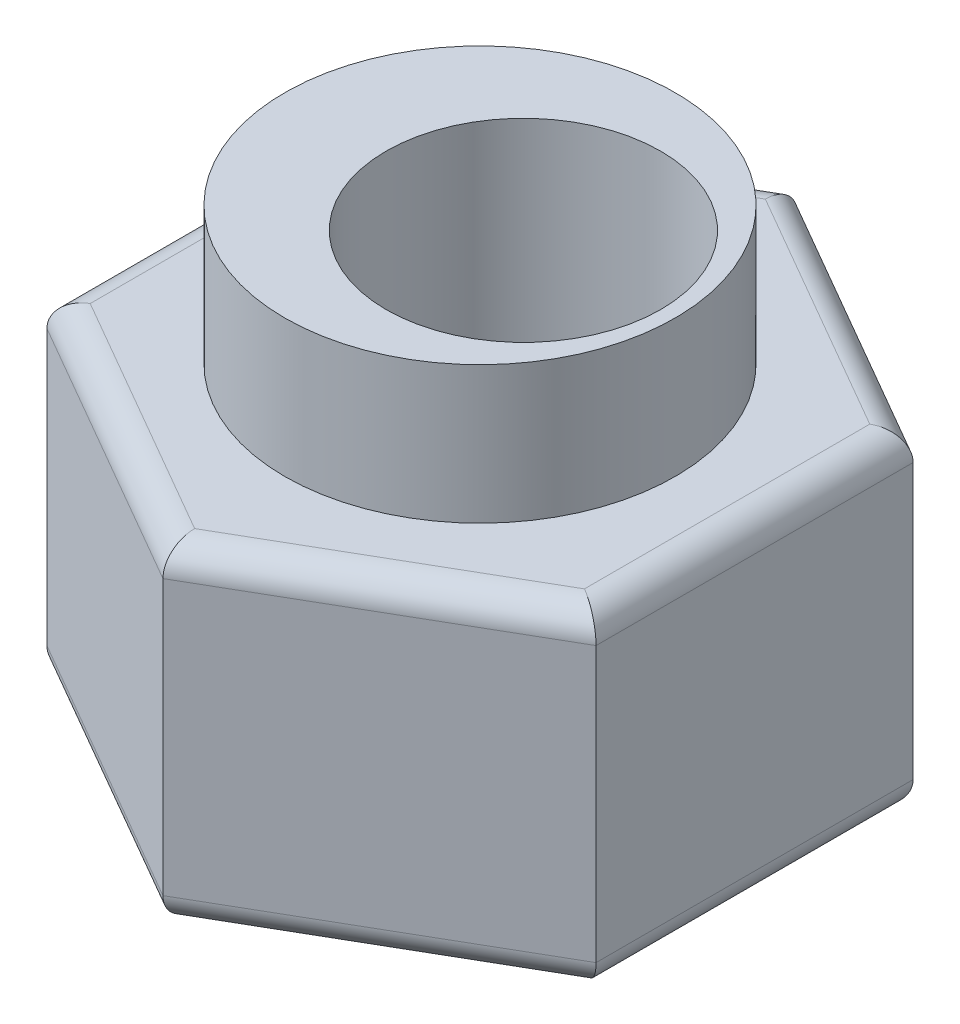
ISO-10303-21;
HEADER;
FILE_DESCRIPTION(('STEP AP214'),'2;1');
FILE_NAME('part.step','',(''),(''),'','','');
FILE_SCHEMA(('AUTOMOTIVE_DESIGN { 1 0 10303 214 1 1 1 1 }'));
ENDSEC;
DATA;
#1=APPLICATION_CONTEXT('core data for automotive mechanical design processes');
#2=APPLICATION_PROTOCOL_DEFINITION('international standard','automotive_design',2000,#1);
#3=PRODUCT_CONTEXT('',#1,'mechanical');
#4=PRODUCT('Part','Part','',(#3));
#5=PRODUCT_RELATED_PRODUCT_CATEGORY('part','',(#4));
#6=PRODUCT_DEFINITION_FORMATION('','',#4);
#7=PRODUCT_DEFINITION_CONTEXT('part definition',#1,'design');
#8=PRODUCT_DEFINITION('design','',#6,#7);
#9=PRODUCT_DEFINITION_SHAPE('','',#8);
#10=(LENGTH_UNIT() NAMED_UNIT(*) SI_UNIT(.MILLI.,.METRE.));
#11=(NAMED_UNIT(*) PLANE_ANGLE_UNIT() SI_UNIT($,.RADIAN.));
#12=(NAMED_UNIT(*) SI_UNIT($,.STERADIAN.) SOLID_ANGLE_UNIT());
#13=UNCERTAINTY_MEASURE_WITH_UNIT(LENGTH_MEASURE(1.E-05),#10,'distance_accuracy_value','');
#14=(GEOMETRIC_REPRESENTATION_CONTEXT(3) GLOBAL_UNCERTAINTY_ASSIGNED_CONTEXT((#13)) GLOBAL_UNIT_ASSIGNED_CONTEXT((#10,
#11,#12)) REPRESENTATION_CONTEXT('',''));
#15=CARTESIAN_POINT('',(0.,0.,0.));
#16=DIRECTION('',(0.,0.,1.));
#17=DIRECTION('',(1.,0.,0.));
#18=AXIS2_PLACEMENT_3D('',#15,#16,#17);
#19=CARTESIAN_POINT('',(0.,6.,5.77350269189626));
#20=DIRECTION('',(-0.5,0.,-0.866025403784439));
#21=DIRECTION('',(-0.866025403784439,0.,0.5));
#22=AXIS2_PLACEMENT_3D('',#19,#20,#21);
#23=PLANE('',#22);
#24=DIRECTION('',(0.,-1.,0.));
#25=VECTOR('',#24,1.);
#26=CARTESIAN_POINT('',(0.,6.,5.77350269189626));
#27=LINE('',#26,#25);
#28=CARTESIAN_POINT('',(0.,5.5,5.77350269189626));
#29=VERTEX_POINT('',#28);
#30=CARTESIAN_POINT('',(0.,0.5,5.77350269189626));
#31=VERTEX_POINT('',#30);
#32=EDGE_CURVE('E163',#29,#31,#27,.T.);
#33=ORIENTED_EDGE('',*,*,#32,.T.);
#34=DIRECTION('',(0.866025403784439,0.,-0.5));
#35=VECTOR('',#34,1.);
#36=CARTESIAN_POINT('',(0.,0.5,5.77350269189626));
#37=LINE('',#36,#35);
#38=CARTESIAN_POINT('',(5.,0.5,2.88675134594813));
#39=VERTEX_POINT('',#38);
#40=EDGE_CURVE('E196',#31,#39,#37,.T.);
#41=ORIENTED_EDGE('',*,*,#40,.T.);
#42=DIRECTION('',(0.,-1.,0.));
#43=VECTOR('',#42,1.);
#44=CARTESIAN_POINT('',(5.,6.,2.88675134594813));
#45=LINE('',#44,#43);
#46=CARTESIAN_POINT('',(5.,5.5,2.88675134594813));
#47=VERTEX_POINT('',#46);
#48=EDGE_CURVE('E169',#47,#39,#45,.T.);
#49=ORIENTED_EDGE('',*,*,#48,.F.);
#50=DIRECTION('',(0.866025403784439,0.,-0.5));
#51=VECTOR('',#50,1.);
#52=CARTESIAN_POINT('',(0.,5.5,5.77350269189626));
#53=LINE('',#52,#51);
#54=EDGE_CURVE('E194',#47,#29,#53,.F.);
#55=ORIENTED_EDGE('',*,*,#54,.T.);
#56=EDGE_LOOP('',(#33,#41,#49,#55));
#57=FACE_BOUND('',#56,.T.);
#58=ADVANCED_FACE('F36',(#57),#23,.F.);
#59=CARTESIAN_POINT('',(5.,6.,2.88675134594813));
#60=DIRECTION('',(-1.,0.,0.));
#61=DIRECTION('',(0.,0.,1.));
#62=AXIS2_PLACEMENT_3D('',#59,#60,#61);
#63=PLANE('',#62);
#64=ORIENTED_EDGE('',*,*,#48,.T.);
#65=DIRECTION('',(0.,0.,-1.));
#66=VECTOR('',#65,1.);
#67=CARTESIAN_POINT('',(5.,0.5,2.88675134594813));
#68=LINE('',#67,#66);
#69=CARTESIAN_POINT('',(5.,0.5,-2.88675134594813));
#70=VERTEX_POINT('',#69);
#71=EDGE_CURVE('E192',#39,#70,#68,.T.);
#72=ORIENTED_EDGE('',*,*,#71,.T.);
#73=DIRECTION('',(0.,-1.,0.));
#74=VECTOR('',#73,1.);
#75=CARTESIAN_POINT('',(5.,6.,-2.88675134594813));
#76=LINE('',#75,#74);
#77=CARTESIAN_POINT('',(5.,5.5,-2.88675134594813));
#78=VERTEX_POINT('',#77);
#79=EDGE_CURVE('E161',#78,#70,#76,.T.);
#80=ORIENTED_EDGE('',*,*,#79,.F.);
#81=DIRECTION('',(0.,0.,-1.));
#82=VECTOR('',#81,1.);
#83=CARTESIAN_POINT('',(5.,5.5,2.88675134594813));
#84=LINE('',#83,#82);
#85=EDGE_CURVE('E190',#78,#47,#84,.F.);
#86=ORIENTED_EDGE('',*,*,#85,.T.);
#87=EDGE_LOOP('',(#64,#72,#80,#86));
#88=FACE_BOUND('',#87,.T.);
#89=ADVANCED_FACE('F247',(#88),#63,.F.);
#90=CARTESIAN_POINT('',(5.,6.,-2.88675134594813));
#91=DIRECTION('',(-0.5,0.,0.866025403784439));
#92=DIRECTION('',(0.866025403784439,0.,0.5));
#93=AXIS2_PLACEMENT_3D('',#90,#91,#92);
#94=PLANE('',#93);
#95=ORIENTED_EDGE('',*,*,#79,.T.);
#96=DIRECTION('',(-0.866025403784439,0.,-0.5));
#97=VECTOR('',#96,1.);
#98=CARTESIAN_POINT('',(5.,0.5,-2.88675134594813));
#99=LINE('',#98,#97);
#100=CARTESIAN_POINT('',(0.,0.5,-5.77350269189626));
#101=VERTEX_POINT('',#100);
#102=EDGE_CURVE('E188',#70,#101,#99,.T.);
#103=ORIENTED_EDGE('',*,*,#102,.T.);
#104=DIRECTION('',(0.,-1.,0.));
#105=VECTOR('',#104,1.);
#106=CARTESIAN_POINT('',(0.,6.,-5.77350269189626));
#107=LINE('',#106,#105);
#108=CARTESIAN_POINT('',(0.,5.5,-5.77350269189626));
#109=VERTEX_POINT('',#108);
#110=EDGE_CURVE('E159',#109,#101,#107,.T.);
#111=ORIENTED_EDGE('',*,*,#110,.F.);
#112=DIRECTION('',(-0.866025403784439,0.,-0.5));
#113=VECTOR('',#112,1.);
#114=CARTESIAN_POINT('',(5.,5.5,-2.88675134594813));
#115=LINE('',#114,#113);
#116=EDGE_CURVE('E186',#109,#78,#115,.F.);
#117=ORIENTED_EDGE('',*,*,#116,.T.);
#118=EDGE_LOOP('',(#95,#103,#111,#117));
#119=FACE_BOUND('',#118,.T.);
#120=ADVANCED_FACE('F274',(#119),#94,.F.);
#121=CARTESIAN_POINT('',(0.,6.,-5.77350269189626));
#122=DIRECTION('',(0.5,0.,0.866025403784439));
#123=DIRECTION('',(0.866025403784439,0.,-0.5));
#124=AXIS2_PLACEMENT_3D('',#121,#122,#123);
#125=PLANE('',#124);
#126=ORIENTED_EDGE('',*,*,#110,.T.);
#127=DIRECTION('',(-0.866025403784439,0.,0.5));
#128=VECTOR('',#127,1.);
#129=CARTESIAN_POINT('',(0.,0.5,-5.77350269189626));
#130=LINE('',#129,#128);
#131=CARTESIAN_POINT('',(-5.,0.5,-2.88675134594813));
#132=VERTEX_POINT('',#131);
#133=EDGE_CURVE('E143',#101,#132,#130,.T.);
#134=ORIENTED_EDGE('',*,*,#133,.T.);
#135=DIRECTION('',(0.,-1.,0.));
#136=VECTOR('',#135,1.);
#137=CARTESIAN_POINT('',(-5.,6.,-2.88675134594813));
#138=LINE('',#137,#136);
#139=CARTESIAN_POINT('',(-5.,5.5,-2.88675134594813));
#140=VERTEX_POINT('',#139);
#141=EDGE_CURVE('E150',#140,#132,#138,.T.);
#142=ORIENTED_EDGE('',*,*,#141,.F.);
#143=DIRECTION('',(-0.866025403784439,0.,0.5));
#144=VECTOR('',#143,1.);
#145=CARTESIAN_POINT('',(0.,5.5,-5.77350269189626));
#146=LINE('',#145,#144);
#147=EDGE_CURVE('E136',#140,#109,#146,.F.);
#148=ORIENTED_EDGE('',*,*,#147,.T.);
#149=EDGE_LOOP('',(#126,#134,#142,#148));
#150=FACE_BOUND('',#149,.T.);
#151=ADVANCED_FACE('F157',(#150),#125,.F.);
#152=CARTESIAN_POINT('',(-5.,6.,-2.88675134594813));
#153=DIRECTION('',(1.,0.,0.));
#154=DIRECTION('',(0.,0.,-1.));
#155=AXIS2_PLACEMENT_3D('',#152,#153,#154);
#156=PLANE('',#155);
#157=ORIENTED_EDGE('',*,*,#141,.T.);
#158=DIRECTION('',(0.,0.,1.));
#159=VECTOR('',#158,1.);
#160=CARTESIAN_POINT('',(-5.,0.5,-2.88675134594813));
#161=LINE('',#160,#159);
#162=CARTESIAN_POINT('',(-5.,0.5,2.88675134594813));
#163=VERTEX_POINT('',#162);
#164=EDGE_CURVE('E153',#132,#163,#161,.T.);
#165=ORIENTED_EDGE('',*,*,#164,.T.);
#166=DIRECTION('',(0.,-1.,0.));
#167=VECTOR('',#166,1.);
#168=CARTESIAN_POINT('',(-5.,6.,2.88675134594813));
#169=LINE('',#168,#167);
#170=CARTESIAN_POINT('',(-5.,5.5,2.88675134594813));
#171=VERTEX_POINT('',#170);
#172=EDGE_CURVE('E152',#171,#163,#169,.T.);
#173=ORIENTED_EDGE('',*,*,#172,.F.);
#174=DIRECTION('',(0.,0.,1.));
#175=VECTOR('',#174,1.);
#176=CARTESIAN_POINT('',(-5.,5.5,-2.88675134594813));
#177=LINE('',#176,#175);
#178=EDGE_CURVE('E129',#171,#140,#177,.F.);
#179=ORIENTED_EDGE('',*,*,#178,.T.);
#180=EDGE_LOOP('',(#157,#165,#173,#179));
#181=FACE_BOUND('',#180,.T.);
#182=ADVANCED_FACE('F149',(#181),#156,.F.);
#183=CARTESIAN_POINT('',(-5.,6.,2.88675134594813));
#184=DIRECTION('',(0.5,0.,-0.866025403784439));
#185=DIRECTION('',(-0.866025403784439,0.,-0.5));
#186=AXIS2_PLACEMENT_3D('',#183,#184,#185);
#187=PLANE('',#186);
#188=ORIENTED_EDGE('',*,*,#172,.T.);
#189=DIRECTION('',(0.866025403784439,0.,0.5));
#190=VECTOR('',#189,1.);
#191=CARTESIAN_POINT('',(-5.,0.5,2.88675134594813));
#192=LINE('',#191,#190);
#193=EDGE_CURVE('E154',#163,#31,#192,.T.);
#194=ORIENTED_EDGE('',*,*,#193,.T.);
#195=ORIENTED_EDGE('',*,*,#32,.F.);
#196=DIRECTION('',(0.866025403784439,0.,0.5));
#197=VECTOR('',#196,1.);
#198=CARTESIAN_POINT('',(-5.,5.5,2.88675134594813));
#199=LINE('',#198,#197);
#200=EDGE_CURVE('E198',#29,#171,#199,.F.);
#201=ORIENTED_EDGE('',*,*,#200,.T.);
#202=EDGE_LOOP('',(#188,#194,#195,#201));
#203=FACE_BOUND('',#202,.T.);
#204=ADVANCED_FACE('F286',(#203),#187,.F.);
#205=CARTESIAN_POINT('',(0.,6.,0.));
#206=DIRECTION('',(0.,1.,0.));
#207=DIRECTION('',(0.,0.,1.));
#208=AXIS2_PLACEMENT_3D('',#205,#206,#207);
#209=PLANE('',#208);
#210=DIRECTION('',(-0.866025403784439,0.,0.5));
#211=VECTOR('',#210,1.);
#212=CARTESIAN_POINT('',(-4.75,6.,-2.45373864405591));
#213=LINE('',#212,#211);
#214=CARTESIAN_POINT('',(0.,6.,-5.19615242270663));
#215=VERTEX_POINT('',#214);
#216=CARTESIAN_POINT('',(-4.5,6.,-2.59807621135332));
#217=VERTEX_POINT('',#216);
#218=EDGE_CURVE('E45',#215,#217,#213,.T.);
#219=ORIENTED_EDGE('',*,*,#218,.T.);
#220=DIRECTION('',(0.,0.,1.));
#221=VECTOR('',#220,1.);
#222=CARTESIAN_POINT('',(-4.5,6.,2.88675134594813));
#223=LINE('',#222,#221);
#224=CARTESIAN_POINT('',(-4.5,6.,2.59807621135332));
#225=VERTEX_POINT('',#224);
#226=EDGE_CURVE('E11',#217,#225,#223,.T.);
#227=ORIENTED_EDGE('',*,*,#226,.T.);
#228=DIRECTION('',(0.866025403784439,0.,0.5));
#229=VECTOR('',#228,1.);
#230=CARTESIAN_POINT('',(0.250000000000001,6.,5.34048999000404));
#231=LINE('',#230,#229);
#232=CARTESIAN_POINT('',(0.,6.,5.19615242270663));
#233=VERTEX_POINT('',#232);
#234=EDGE_CURVE('E202',#225,#233,#231,.T.);
#235=ORIENTED_EDGE('',*,*,#234,.T.);
#236=DIRECTION('',(0.866025403784439,0.,-0.5));
#237=VECTOR('',#236,1.);
#238=CARTESIAN_POINT('',(4.75,6.,2.45373864405591));
#239=LINE('',#238,#237);
#240=CARTESIAN_POINT('',(4.5,6.,2.59807621135332));
#241=VERTEX_POINT('',#240);
#242=EDGE_CURVE('E204',#233,#241,#239,.T.);
#243=ORIENTED_EDGE('',*,*,#242,.T.);
#244=DIRECTION('',(0.,0.,-1.));
#245=VECTOR('',#244,1.);
#246=CARTESIAN_POINT('',(4.5,6.,-2.88675134594813));
#247=LINE('',#246,#245);
#248=CARTESIAN_POINT('',(4.5,6.,-2.59807621135332));
#249=VERTEX_POINT('',#248);
#250=EDGE_CURVE('E206',#241,#249,#247,.T.);
#251=ORIENTED_EDGE('',*,*,#250,.T.);
#252=DIRECTION('',(-0.866025403784439,0.,-0.5));
#253=VECTOR('',#252,1.);
#254=CARTESIAN_POINT('',(-0.250000000000001,6.,-5.34048999000404));
#255=LINE('',#254,#253);
#256=EDGE_CURVE('E56',#249,#215,#255,.T.);
#257=ORIENTED_EDGE('',*,*,#256,.T.);
#258=EDGE_LOOP('',(#219,#227,#235,#243,#251,#257));
#259=FACE_BOUND('',#258,.T.);
#260=CARTESIAN_POINT('',(0.,6.,0.));
#261=DIRECTION('',(0.,1.,0.));
#262=DIRECTION('',(0.,0.,1.));
#263=AXIS2_PLACEMENT_3D('',#260,#261,#262);
#264=CIRCLE('',#263,3.555);
#265=CARTESIAN_POINT('',(0.,6.,3.555));
#266=VERTEX_POINT('',#265);
#267=EDGE_CURVE('E144',#266,#266,#264,.T.);
#268=ORIENTED_EDGE('',*,*,#267,.F.);
#269=EDGE_LOOP('',(#268));
#270=FACE_BOUND('',#269,.T.);
#271=ADVANCED_FACE('F292',(#259,#270),#209,.T.);
#272=CARTESIAN_POINT('',(0.,0.,0.));
#273=DIRECTION('',(0.,1.,0.));
#274=DIRECTION('',(0.,0.,1.));
#275=AXIS2_PLACEMENT_3D('',#272,#273,#274);
#276=PLANE('',#275);
#277=DIRECTION('',(0.,0.,1.));
#278=VECTOR('',#277,1.);
#279=CARTESIAN_POINT('',(-4.5,0.,0.));
#280=LINE('',#279,#278);
#281=CARTESIAN_POINT('',(-4.5,0.,2.59807621135332));
#282=VERTEX_POINT('',#281);
#283=CARTESIAN_POINT('',(-4.5,0.,-2.59807621135332));
#284=VERTEX_POINT('',#283);
#285=EDGE_CURVE('E173',#282,#284,#280,.F.);
#286=ORIENTED_EDGE('',*,*,#285,.T.);
#287=DIRECTION('',(-0.866025403784439,0.,0.5));
#288=VECTOR('',#287,1.);
#289=CARTESIAN_POINT('',(-2.25,0.,-3.89711431702998));
#290=LINE('',#289,#288);
#291=CARTESIAN_POINT('',(0.,0.,-5.19615242270663));
#292=VERTEX_POINT('',#291);
#293=EDGE_CURVE('E183',#284,#292,#290,.F.);
#294=ORIENTED_EDGE('',*,*,#293,.T.);
#295=DIRECTION('',(-0.866025403784439,0.,-0.5));
#296=VECTOR('',#295,1.);
#297=CARTESIAN_POINT('',(2.25,0.,-3.89711431702997));
#298=LINE('',#297,#296);
#299=CARTESIAN_POINT('',(4.5,0.,-2.59807621135332));
#300=VERTEX_POINT('',#299);
#301=EDGE_CURVE('E181',#292,#300,#298,.F.);
#302=ORIENTED_EDGE('',*,*,#301,.T.);
#303=DIRECTION('',(0.,0.,-1.));
#304=VECTOR('',#303,1.);
#305=CARTESIAN_POINT('',(4.5,0.,0.));
#306=LINE('',#305,#304);
#307=CARTESIAN_POINT('',(4.5,0.,2.59807621135332));
#308=VERTEX_POINT('',#307);
#309=EDGE_CURVE('E179',#300,#308,#306,.F.);
#310=ORIENTED_EDGE('',*,*,#309,.T.);
#311=DIRECTION('',(0.866025403784439,0.,-0.5));
#312=VECTOR('',#311,1.);
#313=CARTESIAN_POINT('',(2.25,0.,3.89711431702997));
#314=LINE('',#313,#312);
#315=CARTESIAN_POINT('',(0.,0.,5.19615242270663));
#316=VERTEX_POINT('',#315);
#317=EDGE_CURVE('E177',#308,#316,#314,.F.);
#318=ORIENTED_EDGE('',*,*,#317,.T.);
#319=DIRECTION('',(0.866025403784439,0.,0.5));
#320=VECTOR('',#319,1.);
#321=CARTESIAN_POINT('',(-2.25,0.,3.89711431702997));
#322=LINE('',#321,#320);
#323=EDGE_CURVE('E175',#316,#282,#322,.F.);
#324=ORIENTED_EDGE('',*,*,#323,.T.);
#325=EDGE_LOOP('',(#286,#294,#302,#310,#318,#324));
#326=FACE_BOUND('',#325,.T.);
#327=CARTESIAN_POINT('',(0.79,0.,0.));
#328=DIRECTION('',(0.,1.,0.));
#329=DIRECTION('',(0.,0.,1.));
#330=AXIS2_PLACEMENT_3D('',#327,#328,#329);
#331=CIRCLE('',#330,2.5);
#332=CARTESIAN_POINT('',(0.79,0.,2.5));
#333=VERTEX_POINT('',#332);
#334=EDGE_CURVE('E304',#333,#333,#331,.T.);
#335=ORIENTED_EDGE('',*,*,#334,.T.);
#336=EDGE_LOOP('',(#335));
#337=FACE_BOUND('',#336,.T.);
#338=ADVANCED_FACE('F265',(#326,#337),#276,.F.);
#339=CARTESIAN_POINT('',(0.,8.5,0.));
#340=DIRECTION('',(0.,-1.,0.));
#341=DIRECTION('',(0.,0.,-1.));
#342=AXIS2_PLACEMENT_3D('',#339,#340,#341);
#343=CYLINDRICAL_SURFACE('',#342,3.555);
#344=CARTESIAN_POINT('',(0.,8.5,0.));
#345=DIRECTION('',(0.,1.,0.));
#346=DIRECTION('',(0.,0.,1.));
#347=AXIS2_PLACEMENT_3D('',#344,#345,#346);
#348=CIRCLE('',#347,3.555);
#349=CARTESIAN_POINT('',(0.,8.5,3.555));
#350=VERTEX_POINT('',#349);
#351=EDGE_CURVE('E301',#350,#350,#348,.T.);
#352=ORIENTED_EDGE('',*,*,#351,.F.);
#353=EDGE_LOOP('',(#352));
#354=FACE_BOUND('',#353,.T.);
#355=ORIENTED_EDGE('',*,*,#267,.T.);
#356=EDGE_LOOP('',(#355));
#357=FACE_BOUND('',#356,.T.);
#358=ADVANCED_FACE('F317',(#354,#357),#343,.T.);
#359=CARTESIAN_POINT('',(0.,8.5,0.));
#360=DIRECTION('',(0.,1.,0.));
#361=DIRECTION('',(0.,0.,1.));
#362=AXIS2_PLACEMENT_3D('',#359,#360,#361);
#363=PLANE('',#362);
#364=CARTESIAN_POINT('',(0.79,8.5,0.));
#365=DIRECTION('',(0.,1.,0.));
#366=DIRECTION('',(0.,0.,1.));
#367=AXIS2_PLACEMENT_3D('',#364,#365,#366);
#368=CIRCLE('',#367,2.5);
#369=CARTESIAN_POINT('',(0.79,8.5,2.5));
#370=VERTEX_POINT('',#369);
#371=EDGE_CURVE('E226',#370,#370,#368,.T.);
#372=ORIENTED_EDGE('',*,*,#371,.F.);
#373=EDGE_LOOP('',(#372));
#374=FACE_BOUND('',#373,.T.);
#375=ORIENTED_EDGE('',*,*,#351,.T.);
#376=EDGE_LOOP('',(#375));
#377=FACE_BOUND('',#376,.T.);
#378=ADVANCED_FACE('F315',(#374,#377),#363,.T.);
#379=CARTESIAN_POINT('',(0.79,0.,0.));
#380=DIRECTION('',(0.,1.,0.));
#381=DIRECTION('',(0.,0.,1.));
#382=AXIS2_PLACEMENT_3D('',#379,#380,#381);
#383=CYLINDRICAL_SURFACE('',#382,2.5);
#384=ORIENTED_EDGE('',*,*,#334,.F.);
#385=EDGE_LOOP('',(#384));
#386=FACE_BOUND('',#385,.T.);
#387=ORIENTED_EDGE('',*,*,#371,.T.);
#388=EDGE_LOOP('',(#387));
#389=FACE_BOUND('',#388,.T.);
#390=ADVANCED_FACE('F313',(#386,#389),#383,.F.);
#391=CARTESIAN_POINT('',(-0.25,0.5,5.34048999000404));
#392=DIRECTION('',(0.866025403784439,0.,-0.5));
#393=DIRECTION('',(-0.5,0.,-0.866025403784439));
#394=AXIS2_PLACEMENT_3D('',#391,#392,#393);
#395=CYLINDRICAL_SURFACE('',#394,0.5);
#396=CARTESIAN_POINT('',(0.,0.5,5.19615242270663));
#397=DIRECTION('',(1.,0.,0.));
#398=DIRECTION('',(0.,0.,1.));
#399=AXIS2_PLACEMENT_3D('',#396,#397,#398);
#400=ELLIPSE('',#399,0.577350269189626,0.5);
#401=EDGE_CURVE('E220',#316,#31,#400,.F.);
#402=ORIENTED_EDGE('',*,*,#401,.F.);
#403=ORIENTED_EDGE('',*,*,#317,.F.);
#404=CARTESIAN_POINT('',(4.5,0.5,2.59807621135332));
#405=DIRECTION('',(0.5,0.,-0.866025403784439));
#406=DIRECTION('',(0.866025403784439,0.,0.5));
#407=AXIS2_PLACEMENT_3D('',#404,#405,#406);
#408=ELLIPSE('',#407,0.577350269189626,0.5);
#409=EDGE_CURVE('E223',#39,#308,#408,.T.);
#410=ORIENTED_EDGE('',*,*,#409,.F.);
#411=ORIENTED_EDGE('',*,*,#40,.F.);
#412=EDGE_LOOP('',(#402,#403,#410,#411));
#413=FACE_BOUND('',#412,.T.);
#414=ADVANCED_FACE('F255',(#413),#395,.T.);
#415=CARTESIAN_POINT('',(4.5,0.5,2.88675134594813));
#416=DIRECTION('',(0.,0.,-1.));
#417=DIRECTION('',(-1.,0.,0.));
#418=AXIS2_PLACEMENT_3D('',#415,#416,#417);
#419=CYLINDRICAL_SURFACE('',#418,0.5);
#420=ORIENTED_EDGE('',*,*,#409,.T.);
#421=ORIENTED_EDGE('',*,*,#309,.F.);
#422=CARTESIAN_POINT('',(4.5,0.5,-2.59807621135332));
#423=DIRECTION('',(-0.5,0.,-0.866025403784439));
#424=DIRECTION('',(0.866025403784439,0.,-0.5));
#425=AXIS2_PLACEMENT_3D('',#422,#423,#424);
#426=ELLIPSE('',#425,0.577350269189626,0.5);
#427=EDGE_CURVE('E217',#70,#300,#426,.T.);
#428=ORIENTED_EDGE('',*,*,#427,.F.);
#429=ORIENTED_EDGE('',*,*,#71,.F.);
#430=EDGE_LOOP('',(#420,#421,#428,#429));
#431=FACE_BOUND('',#430,.T.);
#432=ADVANCED_FACE('F270',(#431),#419,.T.);
#433=CARTESIAN_POINT('',(-4.75,0.5,2.45373864405591));
#434=DIRECTION('',(0.866025403784439,0.,0.5));
#435=DIRECTION('',(0.5,0.,-0.866025403784439));
#436=AXIS2_PLACEMENT_3D('',#433,#434,#435);
#437=CYLINDRICAL_SURFACE('',#436,0.5);
#438=ORIENTED_EDGE('',*,*,#401,.T.);
#439=ORIENTED_EDGE('',*,*,#193,.F.);
#440=CARTESIAN_POINT('',(-4.5,0.5,2.59807621135332));
#441=DIRECTION('',(0.5,0.,0.866025403784439));
#442=DIRECTION('',(-0.866025403784439,0.,0.5));
#443=AXIS2_PLACEMENT_3D('',#440,#441,#442);
#444=ELLIPSE('',#443,0.577350269189626,0.5);
#445=EDGE_CURVE('E214',#282,#163,#444,.F.);
#446=ORIENTED_EDGE('',*,*,#445,.F.);
#447=ORIENTED_EDGE('',*,*,#323,.F.);
#448=EDGE_LOOP('',(#438,#439,#446,#447));
#449=FACE_BOUND('',#448,.T.);
#450=ADVANCED_FACE('F261',(#449),#437,.T.);
#451=CARTESIAN_POINT('',(4.75,0.5,-2.45373864405591));
#452=DIRECTION('',(-0.866025403784439,0.,-0.5));
#453=DIRECTION('',(-0.5,0.,0.866025403784439));
#454=AXIS2_PLACEMENT_3D('',#451,#452,#453);
#455=CYLINDRICAL_SURFACE('',#454,0.5);
#456=ORIENTED_EDGE('',*,*,#427,.T.);
#457=ORIENTED_EDGE('',*,*,#301,.F.);
#458=CARTESIAN_POINT('',(0.,0.5,-5.19615242270663));
#459=DIRECTION('',(-1.,0.,0.));
#460=DIRECTION('',(0.,0.,-1.));
#461=AXIS2_PLACEMENT_3D('',#458,#459,#460);
#462=ELLIPSE('',#461,0.577350269189626,0.5);
#463=EDGE_CURVE('E212',#101,#292,#462,.T.);
#464=ORIENTED_EDGE('',*,*,#463,.F.);
#465=ORIENTED_EDGE('',*,*,#102,.F.);
#466=EDGE_LOOP('',(#456,#457,#464,#465));
#467=FACE_BOUND('',#466,.T.);
#468=ADVANCED_FACE('F278',(#467),#455,.T.);
#469=CARTESIAN_POINT('',(-4.5,0.5,-2.88675134594813));
#470=DIRECTION('',(0.,0.,1.));
#471=DIRECTION('',(1.,0.,0.));
#472=AXIS2_PLACEMENT_3D('',#469,#470,#471);
#473=CYLINDRICAL_SURFACE('',#472,0.5);
#474=ORIENTED_EDGE('',*,*,#445,.T.);
#475=ORIENTED_EDGE('',*,*,#164,.F.);
#476=CARTESIAN_POINT('',(-4.5,0.5,-2.59807621135332));
#477=DIRECTION('',(-0.5,0.,0.866025403784439));
#478=DIRECTION('',(0.866025403784439,0.,0.5));
#479=AXIS2_PLACEMENT_3D('',#476,#477,#478);
#480=ELLIPSE('',#479,0.577350269189626,0.5);
#481=EDGE_CURVE('E210',#284,#132,#480,.F.);
#482=ORIENTED_EDGE('',*,*,#481,.F.);
#483=ORIENTED_EDGE('',*,*,#285,.F.);
#484=EDGE_LOOP('',(#474,#475,#482,#483));
#485=FACE_BOUND('',#484,.T.);
#486=ADVANCED_FACE('F284',(#485),#473,.T.);
#487=CARTESIAN_POINT('',(0.249999999999999,0.5,-5.34048999000404));
#488=DIRECTION('',(-0.866025403784439,0.,0.5));
#489=DIRECTION('',(0.5,0.,0.866025403784439));
#490=AXIS2_PLACEMENT_3D('',#487,#488,#489);
#491=CYLINDRICAL_SURFACE('',#490,0.5);
#492=ORIENTED_EDGE('',*,*,#463,.T.);
#493=ORIENTED_EDGE('',*,*,#293,.F.);
#494=ORIENTED_EDGE('',*,*,#481,.T.);
#495=ORIENTED_EDGE('',*,*,#133,.F.);
#496=EDGE_LOOP('',(#492,#493,#494,#495));
#497=FACE_BOUND('',#496,.T.);
#498=ADVANCED_FACE('F280',(#497),#491,.T.);
#499=CARTESIAN_POINT('',(4.5,5.5,0.));
#500=DIRECTION('',(0.,0.,1.));
#501=DIRECTION('',(1.,0.,0.));
#502=AXIS2_PLACEMENT_3D('',#499,#500,#501);
#503=CYLINDRICAL_SURFACE('',#502,0.5);
#504=CARTESIAN_POINT('',(4.5,5.5,2.59807621135332));
#505=DIRECTION('',(-0.5,0.,0.866025403784439));
#506=DIRECTION('',(-0.866025403784439,0.,-0.5));
#507=AXIS2_PLACEMENT_3D('',#504,#505,#506);
#508=ELLIPSE('',#507,0.577350269189626,0.5);
#509=EDGE_CURVE('E230',#47,#241,#508,.T.);
#510=ORIENTED_EDGE('',*,*,#509,.F.);
#511=ORIENTED_EDGE('',*,*,#85,.F.);
#512=CARTESIAN_POINT('',(4.5,5.5,-2.59807621135332));
#513=DIRECTION('',(0.5,0.,0.866025403784439));
#514=DIRECTION('',(-0.866025403784439,0.,0.5));
#515=AXIS2_PLACEMENT_3D('',#512,#513,#514);
#516=ELLIPSE('',#515,0.577350269189626,0.5);
#517=EDGE_CURVE('E40',#249,#78,#516,.F.);
#518=ORIENTED_EDGE('',*,*,#517,.F.);
#519=ORIENTED_EDGE('',*,*,#250,.F.);
#520=EDGE_LOOP('',(#510,#511,#518,#519));
#521=FACE_BOUND('',#520,.T.);
#522=ADVANCED_FACE('F38',(#521),#503,.T.);
#523=CARTESIAN_POINT('',(2.25,5.5,-3.89711431702998));
#524=DIRECTION('',(0.866025403784439,0.,0.5));
#525=DIRECTION('',(0.5,0.,-0.866025403784439));
#526=AXIS2_PLACEMENT_3D('',#523,#524,#525);
#527=CYLINDRICAL_SURFACE('',#526,0.5);
#528=ORIENTED_EDGE('',*,*,#517,.T.);
#529=ORIENTED_EDGE('',*,*,#116,.F.);
#530=CARTESIAN_POINT('',(0.,5.5,-5.19615242270663));
#531=DIRECTION('',(1.,0.,0.));
#532=DIRECTION('',(0.,0.,1.));
#533=AXIS2_PLACEMENT_3D('',#530,#531,#532);
#534=ELLIPSE('',#533,0.577350269189626,0.5);
#535=EDGE_CURVE('E138',#215,#109,#534,.F.);
#536=ORIENTED_EDGE('',*,*,#535,.F.);
#537=ORIENTED_EDGE('',*,*,#256,.F.);
#538=EDGE_LOOP('',(#528,#529,#536,#537));
#539=FACE_BOUND('',#538,.T.);
#540=ADVANCED_FACE('F240',(#539),#527,.T.);
#541=CARTESIAN_POINT('',(2.25,5.5,3.89711431702997));
#542=DIRECTION('',(-0.866025403784439,0.,0.5));
#543=DIRECTION('',(0.5,0.,0.866025403784439));
#544=AXIS2_PLACEMENT_3D('',#541,#542,#543);
#545=CYLINDRICAL_SURFACE('',#544,0.5);
#546=ORIENTED_EDGE('',*,*,#509,.T.);
#547=ORIENTED_EDGE('',*,*,#242,.F.);
#548=CARTESIAN_POINT('',(0.,5.5,5.19615242270663));
#549=DIRECTION('',(-1.,0.,0.));
#550=DIRECTION('',(0.,0.,-1.));
#551=AXIS2_PLACEMENT_3D('',#548,#549,#550);
#552=ELLIPSE('',#551,0.577350269189626,0.5);
#553=EDGE_CURVE('E132',#29,#233,#552,.T.);
#554=ORIENTED_EDGE('',*,*,#553,.F.);
#555=ORIENTED_EDGE('',*,*,#54,.F.);
#556=EDGE_LOOP('',(#546,#547,#554,#555));
#557=FACE_BOUND('',#556,.T.);
#558=ADVANCED_FACE('F353',(#557),#545,.T.);
#559=CARTESIAN_POINT('',(-2.25,5.5,-3.89711431702998));
#560=DIRECTION('',(0.866025403784439,0.,-0.5));
#561=DIRECTION('',(-0.5,0.,-0.866025403784439));
#562=AXIS2_PLACEMENT_3D('',#559,#560,#561);
#563=CYLINDRICAL_SURFACE('',#562,0.5);
#564=ORIENTED_EDGE('',*,*,#535,.T.);
#565=ORIENTED_EDGE('',*,*,#147,.F.);
#566=CARTESIAN_POINT('',(-4.5,5.5,-2.59807621135332));
#567=DIRECTION('',(0.5,0.,-0.866025403784439));
#568=DIRECTION('',(0.866025403784439,0.,0.5));
#569=AXIS2_PLACEMENT_3D('',#566,#567,#568);
#570=ELLIPSE('',#569,0.577350269189626,0.5);
#571=EDGE_CURVE('E125',#217,#140,#570,.F.);
#572=ORIENTED_EDGE('',*,*,#571,.F.);
#573=ORIENTED_EDGE('',*,*,#218,.F.);
#574=EDGE_LOOP('',(#564,#565,#572,#573));
#575=FACE_BOUND('',#574,.T.);
#576=ADVANCED_FACE('F137',(#575),#563,.T.);
#577=CARTESIAN_POINT('',(-2.25,5.5,3.89711431702997));
#578=DIRECTION('',(-0.866025403784439,0.,-0.5));
#579=DIRECTION('',(-0.5,0.,0.866025403784439));
#580=AXIS2_PLACEMENT_3D('',#577,#578,#579);
#581=CYLINDRICAL_SURFACE('',#580,0.5);
#582=ORIENTED_EDGE('',*,*,#553,.T.);
#583=ORIENTED_EDGE('',*,*,#234,.F.);
#584=CARTESIAN_POINT('',(-4.5,5.5,2.59807621135332));
#585=DIRECTION('',(-0.5,0.,-0.866025403784439));
#586=DIRECTION('',(-0.866025403784439,0.,0.5));
#587=AXIS2_PLACEMENT_3D('',#584,#585,#586);
#588=ELLIPSE('',#587,0.577350269189626,0.5);
#589=EDGE_CURVE('E133',#171,#225,#588,.T.);
#590=ORIENTED_EDGE('',*,*,#589,.F.);
#591=ORIENTED_EDGE('',*,*,#200,.F.);
#592=EDGE_LOOP('',(#582,#583,#590,#591));
#593=FACE_BOUND('',#592,.T.);
#594=ADVANCED_FACE('F290',(#593),#581,.T.);
#595=CARTESIAN_POINT('',(-4.5,5.5,0.));
#596=DIRECTION('',(0.,0.,-1.));
#597=DIRECTION('',(-1.,0.,0.));
#598=AXIS2_PLACEMENT_3D('',#595,#596,#597);
#599=CYLINDRICAL_SURFACE('',#598,0.5);
#600=ORIENTED_EDGE('',*,*,#571,.T.);
#601=ORIENTED_EDGE('',*,*,#178,.F.);
#602=ORIENTED_EDGE('',*,*,#589,.T.);
#603=ORIENTED_EDGE('',*,*,#226,.F.);
#604=EDGE_LOOP('',(#600,#601,#602,#603));
#605=FACE_BOUND('',#604,.T.);
#606=ADVANCED_FACE('F127',(#605),#599,.T.);
#607=CLOSED_SHELL('',(#58,#89,#120,#151,#182,#204,#271,#338,#358,#378,#390,#414,#432,#450,#468,
#486,#498,#522,#540,#558,#576,#594,#606));
#608=MANIFOLD_SOLID_BREP('B2',#607);
#609=ADVANCED_BREP_SHAPE_REPRESENTATION('',(#18,#608),#14);
#610=SHAPE_DEFINITION_REPRESENTATION(#9,#609);
ENDSEC;
END-ISO-10303-21;
